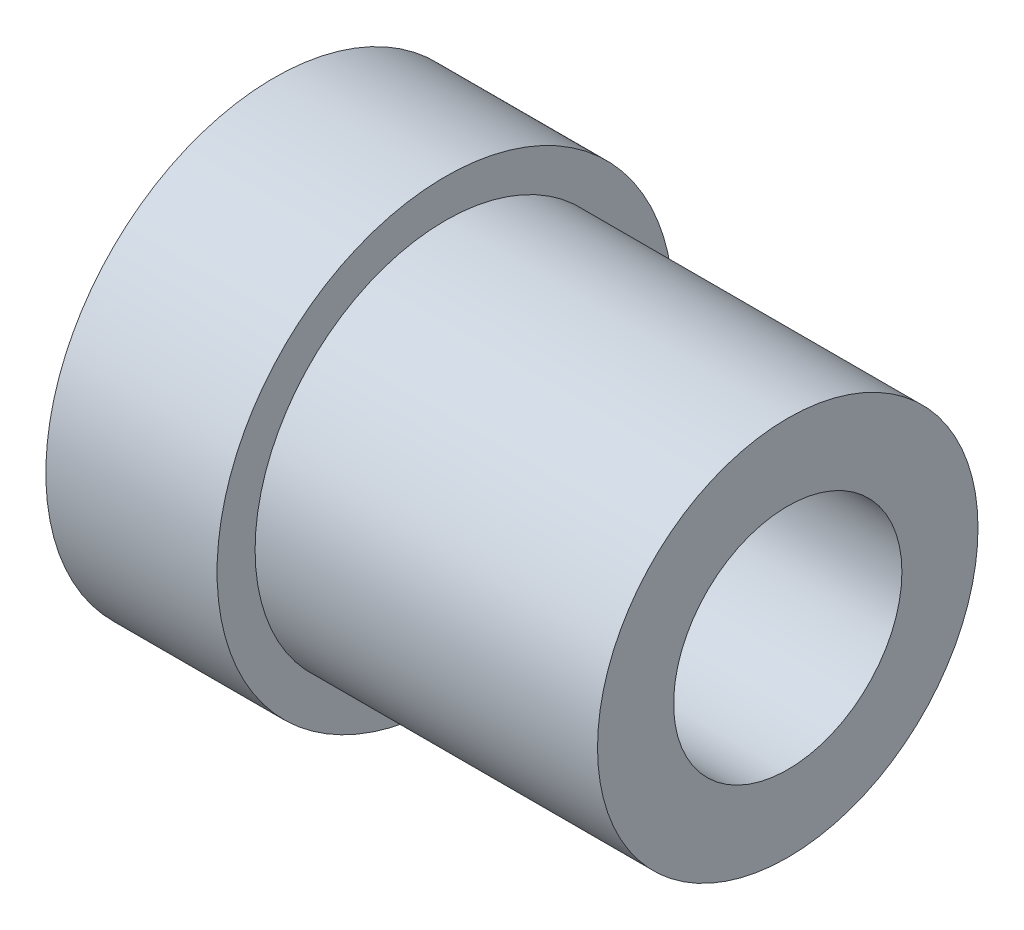
ISO-10303-21;
HEADER;
FILE_DESCRIPTION(('STEP AP214'),'2;1');
FILE_NAME('part.step','',(''),(''),'','','');
FILE_SCHEMA(('AUTOMOTIVE_DESIGN { 1 0 10303 214 1 1 1 1 }'));
ENDSEC;
DATA;
#1=APPLICATION_CONTEXT('core data for automotive mechanical design processes');
#2=APPLICATION_PROTOCOL_DEFINITION('international standard','automotive_design',2000,#1);
#3=PRODUCT_CONTEXT('',#1,'mechanical');
#4=PRODUCT('Part','Part','',(#3));
#5=PRODUCT_RELATED_PRODUCT_CATEGORY('part','',(#4));
#6=PRODUCT_DEFINITION_FORMATION('','',#4);
#7=PRODUCT_DEFINITION_CONTEXT('part definition',#1,'design');
#8=PRODUCT_DEFINITION('design','',#6,#7);
#9=PRODUCT_DEFINITION_SHAPE('','',#8);
#10=(LENGTH_UNIT() NAMED_UNIT(*) SI_UNIT(.MILLI.,.METRE.));
#11=(NAMED_UNIT(*) PLANE_ANGLE_UNIT() SI_UNIT($,.RADIAN.));
#12=(NAMED_UNIT(*) SI_UNIT($,.STERADIAN.) SOLID_ANGLE_UNIT());
#13=UNCERTAINTY_MEASURE_WITH_UNIT(LENGTH_MEASURE(1.E-05),#10,'distance_accuracy_value','');
#14=(GEOMETRIC_REPRESENTATION_CONTEXT(3) GLOBAL_UNCERTAINTY_ASSIGNED_CONTEXT((#13)) GLOBAL_UNIT_ASSIGNED_CONTEXT((#10,
#11,#12)) REPRESENTATION_CONTEXT('',''));
#15=CARTESIAN_POINT('',(0.,0.,0.));
#16=DIRECTION('',(0.,0.,1.));
#17=DIRECTION('',(1.,0.,0.));
#18=AXIS2_PLACEMENT_3D('',#15,#16,#17);
#19=CARTESIAN_POINT('',(4.5,0.,0.));
#20=DIRECTION('',(1.,0.,0.));
#21=DIRECTION('',(0.,0.,-1.));
#22=AXIS2_PLACEMENT_3D('',#19,#20,#21);
#23=PLANE('',#22);
#24=CARTESIAN_POINT('',(4.5,0.,0.));
#25=DIRECTION('',(1.,0.,0.));
#26=DIRECTION('',(0.,0.,-1.));
#27=AXIS2_PLACEMENT_3D('',#24,#25,#26);
#28=CIRCLE('',#27,5.);
#29=CARTESIAN_POINT('',(4.5,0.,-5.));
#30=VERTEX_POINT('',#29);
#31=EDGE_CURVE('E10',#30,#30,#28,.T.);
#32=ORIENTED_EDGE('',*,*,#31,.F.);
#33=EDGE_LOOP('',(#32));
#34=FACE_BOUND('',#33,.T.);
#35=CARTESIAN_POINT('',(4.5,0.,0.));
#36=DIRECTION('',(1.,0.,0.));
#37=DIRECTION('',(0.,0.,-1.));
#38=AXIS2_PLACEMENT_3D('',#35,#36,#37);
#39=CIRCLE('',#38,6.);
#40=CARTESIAN_POINT('',(4.5,0.,-6.));
#41=VERTEX_POINT('',#40);
#42=EDGE_CURVE('E45',#41,#41,#39,.T.);
#43=ORIENTED_EDGE('',*,*,#42,.T.);
#44=EDGE_LOOP('',(#43));
#45=FACE_BOUND('',#44,.T.);
#46=ADVANCED_FACE('F37',(#34,#45),#23,.T.);
#47=CARTESIAN_POINT('',(0.,0.,0.));
#48=DIRECTION('',(1.,0.,0.));
#49=DIRECTION('',(0.,0.,-1.));
#50=AXIS2_PLACEMENT_3D('',#47,#48,#49);
#51=PLANE('',#50);
#52=CARTESIAN_POINT('',(0.,0.,0.));
#53=DIRECTION('',(1.,0.,0.));
#54=DIRECTION('',(0.,0.,-1.));
#55=AXIS2_PLACEMENT_3D('',#52,#53,#54);
#56=CIRCLE('',#55,6.);
#57=CARTESIAN_POINT('',(0.,0.,-6.));
#58=VERTEX_POINT('',#57);
#59=EDGE_CURVE('E41',#58,#58,#56,.T.);
#60=ORIENTED_EDGE('',*,*,#59,.F.);
#61=EDGE_LOOP('',(#60));
#62=FACE_BOUND('',#61,.T.);
#63=CARTESIAN_POINT('',(0.,0.,0.));
#64=DIRECTION('',(1.,0.,0.));
#65=DIRECTION('',(0.,0.,-1.));
#66=AXIS2_PLACEMENT_3D('',#63,#64,#65);
#67=CIRCLE('',#66,3.);
#68=CARTESIAN_POINT('',(0.,0.,-3.));
#69=VERTEX_POINT('',#68);
#70=EDGE_CURVE('E54',#69,#69,#67,.T.);
#71=ORIENTED_EDGE('',*,*,#70,.T.);
#72=EDGE_LOOP('',(#71));
#73=FACE_BOUND('',#72,.T.);
#74=ADVANCED_FACE('F81',(#62,#73),#51,.F.);
#75=CARTESIAN_POINT('',(4.5,0.,0.));
#76=DIRECTION('',(-1.,0.,0.));
#77=DIRECTION('',(0.,0.,1.));
#78=AXIS2_PLACEMENT_3D('',#75,#76,#77);
#79=CYLINDRICAL_SURFACE('',#78,6.);
#80=ORIENTED_EDGE('',*,*,#42,.F.);
#81=EDGE_LOOP('',(#80));
#82=FACE_BOUND('',#81,.T.);
#83=ORIENTED_EDGE('',*,*,#59,.T.);
#84=EDGE_LOOP('',(#83));
#85=FACE_BOUND('',#84,.T.);
#86=ADVANCED_FACE('F39',(#82,#85),#79,.T.);
#87=CARTESIAN_POINT('',(4.5,0.,0.));
#88=DIRECTION('',(-1.,0.,0.));
#89=DIRECTION('',(0.,0.,1.));
#90=AXIS2_PLACEMENT_3D('',#87,#88,#89);
#91=CYLINDRICAL_SURFACE('',#90,3.);
#92=ORIENTED_EDGE('',*,*,#70,.F.);
#93=EDGE_LOOP('',(#92));
#94=FACE_BOUND('',#93,.T.);
#95=CARTESIAN_POINT('',(13.5,0.,0.));
#96=DIRECTION('',(1.,0.,0.));
#97=DIRECTION('',(0.,0.,-1.));
#98=AXIS2_PLACEMENT_3D('',#95,#96,#97);
#99=CIRCLE('',#98,3.);
#100=CARTESIAN_POINT('',(13.5,0.,-3.));
#101=VERTEX_POINT('',#100);
#102=EDGE_CURVE('E60',#101,#101,#99,.T.);
#103=ORIENTED_EDGE('',*,*,#102,.T.);
#104=EDGE_LOOP('',(#103));
#105=FACE_BOUND('',#104,.T.);
#106=ADVANCED_FACE('F66',(#94,#105),#91,.F.);
#107=CARTESIAN_POINT('',(13.5,0.,0.));
#108=DIRECTION('',(1.,0.,0.));
#109=DIRECTION('',(0.,0.,-1.));
#110=AXIS2_PLACEMENT_3D('',#107,#108,#109);
#111=PLANE('',#110);
#112=CARTESIAN_POINT('',(13.5,0.,0.));
#113=DIRECTION('',(1.,0.,0.));
#114=DIRECTION('',(0.,0.,-1.));
#115=AXIS2_PLACEMENT_3D('',#112,#113,#114);
#116=CIRCLE('',#115,5.);
#117=CARTESIAN_POINT('',(13.5,0.,-5.));
#118=VERTEX_POINT('',#117);
#119=EDGE_CURVE('E52',#118,#118,#116,.T.);
#120=ORIENTED_EDGE('',*,*,#119,.T.);
#121=EDGE_LOOP('',(#120));
#122=FACE_BOUND('',#121,.T.);
#123=ORIENTED_EDGE('',*,*,#102,.F.);
#124=EDGE_LOOP('',(#123));
#125=FACE_BOUND('',#124,.T.);
#126=ADVANCED_FACE('F68',(#122,#125),#111,.T.);
#127=CARTESIAN_POINT('',(13.5,0.,0.));
#128=DIRECTION('',(-1.,0.,0.));
#129=DIRECTION('',(0.,0.,1.));
#130=AXIS2_PLACEMENT_3D('',#127,#128,#129);
#131=CYLINDRICAL_SURFACE('',#130,5.);
#132=ORIENTED_EDGE('',*,*,#119,.F.);
#133=EDGE_LOOP('',(#132));
#134=FACE_BOUND('',#133,.T.);
#135=ORIENTED_EDGE('',*,*,#31,.T.);
#136=EDGE_LOOP('',(#135));
#137=FACE_BOUND('',#136,.T.);
#138=ADVANCED_FACE('F70',(#134,#137),#131,.T.);
#139=CLOSED_SHELL('',(#46,#74,#86,#106,#126,#138));
#140=MANIFOLD_SOLID_BREP('B2',#139);
#141=ADVANCED_BREP_SHAPE_REPRESENTATION('',(#18,#140),#14);
#142=SHAPE_DEFINITION_REPRESENTATION(#9,#141);
ENDSEC;
END-ISO-10303-21;
